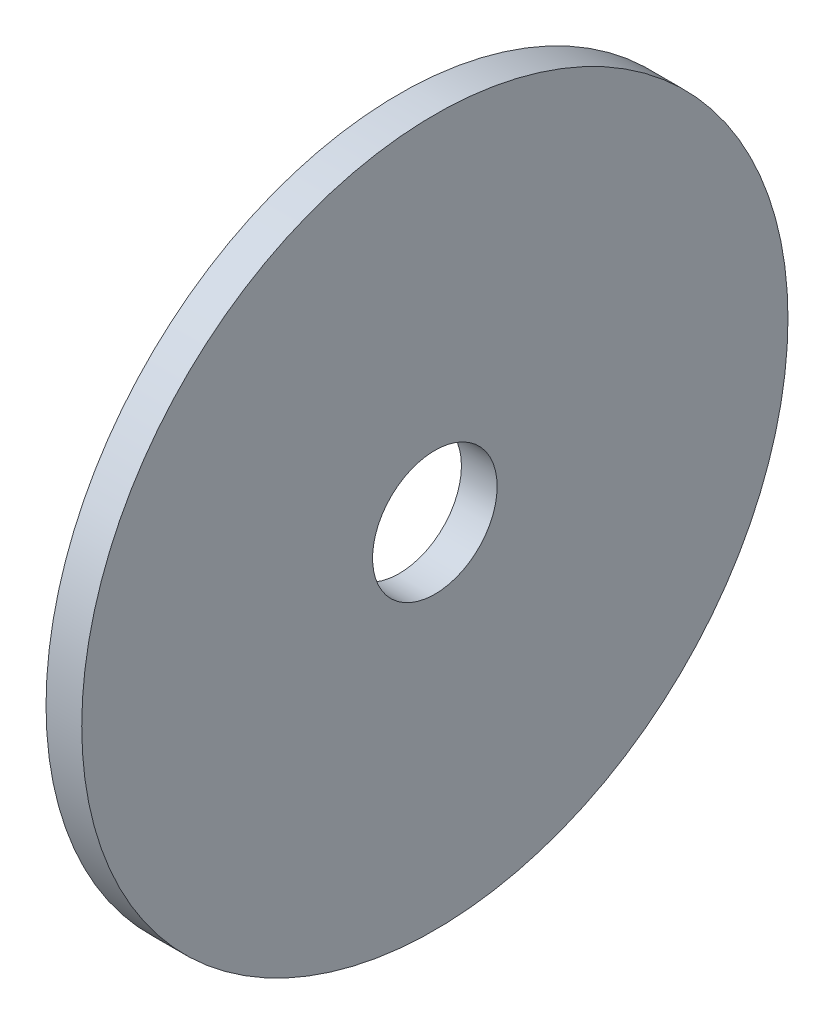
ISO-10303-21;
HEADER;
FILE_DESCRIPTION(('STEP AP214'),'2;1');
FILE_NAME('part.step','',(''),(''),'','','');
FILE_SCHEMA(('AUTOMOTIVE_DESIGN { 1 0 10303 214 1 1 1 1 }'));
ENDSEC;
DATA;
#1=APPLICATION_CONTEXT('core data for automotive mechanical design processes');
#2=APPLICATION_PROTOCOL_DEFINITION('international standard','automotive_design',2000,#1);
#3=PRODUCT_CONTEXT('',#1,'mechanical');
#4=PRODUCT('Part','Part','',(#3));
#5=PRODUCT_RELATED_PRODUCT_CATEGORY('part','',(#4));
#6=PRODUCT_DEFINITION_FORMATION('','',#4);
#7=PRODUCT_DEFINITION_CONTEXT('part definition',#1,'design');
#8=PRODUCT_DEFINITION('design','',#6,#7);
#9=PRODUCT_DEFINITION_SHAPE('','',#8);
#10=(LENGTH_UNIT() NAMED_UNIT(*) SI_UNIT(.MILLI.,.METRE.));
#11=(NAMED_UNIT(*) PLANE_ANGLE_UNIT() SI_UNIT($,.RADIAN.));
#12=(NAMED_UNIT(*) SI_UNIT($,.STERADIAN.) SOLID_ANGLE_UNIT());
#13=UNCERTAINTY_MEASURE_WITH_UNIT(LENGTH_MEASURE(1.E-05),#10,'distance_accuracy_value','');
#14=(GEOMETRIC_REPRESENTATION_CONTEXT(3) GLOBAL_UNCERTAINTY_ASSIGNED_CONTEXT((#13)) GLOBAL_UNIT_ASSIGNED_CONTEXT((#10,
#11,#12)) REPRESENTATION_CONTEXT('',''));
#15=CARTESIAN_POINT('',(0.,0.,0.));
#16=DIRECTION('',(0.,0.,1.));
#17=DIRECTION('',(1.,0.,0.));
#18=AXIS2_PLACEMENT_3D('',#15,#16,#17);
#19=CARTESIAN_POINT('',(509.651,0.,0.));
#20=DIRECTION('',(1.,0.,0.));
#21=DIRECTION('',(0.,0.,-1.));
#22=AXIS2_PLACEMENT_3D('',#19,#20,#21);
#23=PLANE('',#22);
#24=CARTESIAN_POINT('',(509.651,0.,0.));
#25=DIRECTION('',(1.,0.,0.));
#26=DIRECTION('',(0.,0.,-1.));
#27=AXIS2_PLACEMENT_3D('',#24,#25,#26);
#28=CIRCLE('',#27,9.525);
#29=CARTESIAN_POINT('',(509.651,0.,-9.525));
#30=VERTEX_POINT('',#29);
#31=EDGE_CURVE('E49',#30,#30,#28,.T.);
#32=ORIENTED_EDGE('',*,*,#31,.F.);
#33=EDGE_LOOP('',(#32));
#34=FACE_BOUND('',#33,.T.);
#35=CARTESIAN_POINT('',(509.651,0.,0.));
#36=DIRECTION('',(1.,0.,0.));
#37=DIRECTION('',(0.,0.,-1.));
#38=AXIS2_PLACEMENT_3D('',#35,#36,#37);
#39=CIRCLE('',#38,53.9922702391482);
#40=CARTESIAN_POINT('',(509.651,0.,-53.9922702391482));
#41=VERTEX_POINT('',#40);
#42=EDGE_CURVE('E60',#41,#41,#39,.T.);
#43=ORIENTED_EDGE('',*,*,#42,.T.);
#44=EDGE_LOOP('',(#43));
#45=FACE_BOUND('',#44,.T.);
#46=ADVANCED_FACE('F46',(#34,#45),#23,.T.);
#47=CARTESIAN_POINT('',(504.19,0.,0.));
#48=DIRECTION('',(1.,0.,0.));
#49=DIRECTION('',(0.,0.,-1.));
#50=AXIS2_PLACEMENT_3D('',#47,#48,#49);
#51=CYLINDRICAL_SURFACE('',#50,53.9922702391482);
#52=CARTESIAN_POINT('',(504.19,0.,0.));
#53=DIRECTION('',(1.,0.,0.));
#54=DIRECTION('',(0.,0.,-1.));
#55=AXIS2_PLACEMENT_3D('',#52,#53,#54);
#56=CIRCLE('',#55,53.9922702391482);
#57=CARTESIAN_POINT('',(504.19,0.,-53.9922702391482));
#58=VERTEX_POINT('',#57);
#59=EDGE_CURVE('E58',#58,#58,#56,.T.);
#60=ORIENTED_EDGE('',*,*,#59,.T.);
#61=EDGE_LOOP('',(#60));
#62=FACE_BOUND('',#61,.T.);
#63=ORIENTED_EDGE('',*,*,#42,.F.);
#64=EDGE_LOOP('',(#63));
#65=FACE_BOUND('',#64,.T.);
#66=ADVANCED_FACE('F68',(#62,#65),#51,.T.);
#67=CARTESIAN_POINT('',(504.19,0.,0.));
#68=DIRECTION('',(1.,0.,0.));
#69=DIRECTION('',(0.,0.,-1.));
#70=AXIS2_PLACEMENT_3D('',#67,#68,#69);
#71=CYLINDRICAL_SURFACE('',#70,9.525);
#72=CARTESIAN_POINT('',(504.19,0.,0.));
#73=DIRECTION('',(1.,0.,0.));
#74=DIRECTION('',(0.,0.,-1.));
#75=AXIS2_PLACEMENT_3D('',#72,#73,#74);
#76=CIRCLE('',#75,9.525);
#77=CARTESIAN_POINT('',(504.19,0.,-9.525));
#78=VERTEX_POINT('',#77);
#79=EDGE_CURVE('E11',#78,#78,#76,.T.);
#80=ORIENTED_EDGE('',*,*,#79,.F.);
#81=EDGE_LOOP('',(#80));
#82=FACE_BOUND('',#81,.T.);
#83=ORIENTED_EDGE('',*,*,#31,.T.);
#84=EDGE_LOOP('',(#83));
#85=FACE_BOUND('',#84,.T.);
#86=ADVANCED_FACE('F73',(#82,#85),#71,.F.);
#87=CARTESIAN_POINT('',(504.19,0.,0.));
#88=DIRECTION('',(1.,0.,0.));
#89=DIRECTION('',(0.,0.,-1.));
#90=AXIS2_PLACEMENT_3D('',#87,#88,#89);
#91=PLANE('',#90);
#92=ORIENTED_EDGE('',*,*,#79,.T.);
#93=EDGE_LOOP('',(#92));
#94=FACE_BOUND('',#93,.T.);
#95=ORIENTED_EDGE('',*,*,#59,.F.);
#96=EDGE_LOOP('',(#95));
#97=FACE_BOUND('',#96,.T.);
#98=ADVANCED_FACE('F71',(#94,#97),#91,.F.);
#99=CLOSED_SHELL('',(#46,#66,#86,#98));
#100=MANIFOLD_SOLID_BREP('B2',#99);
#101=ADVANCED_BREP_SHAPE_REPRESENTATION('',(#18,#100),#14);
#102=SHAPE_DEFINITION_REPRESENTATION(#9,#101);
ENDSEC;
END-ISO-10303-21;
